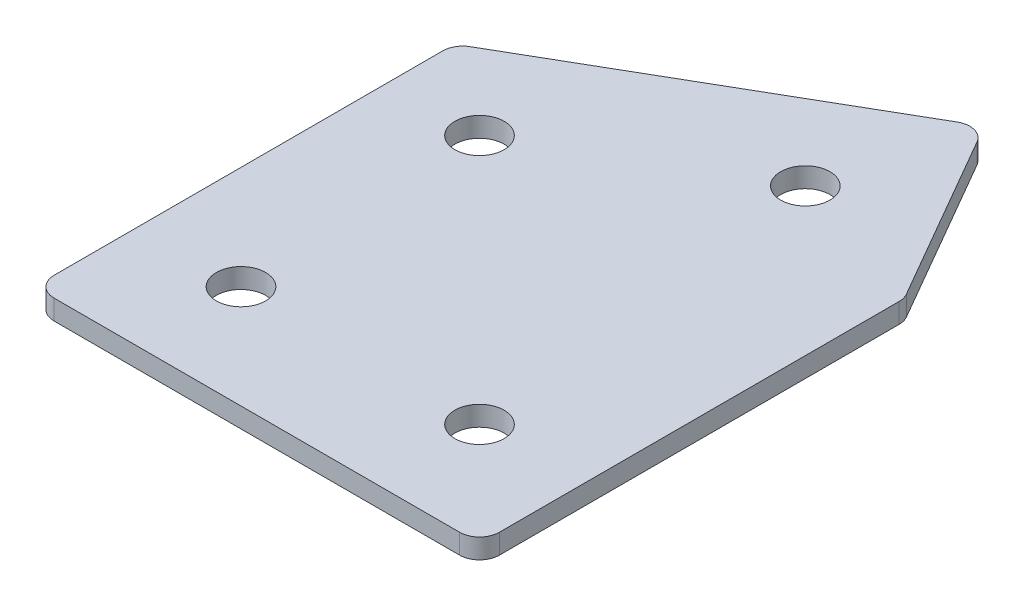
ISO-10303-21;
HEADER;
FILE_DESCRIPTION(('STEP AP214'),'2;1');
FILE_NAME('part.step','',(''),(''),'','','');
FILE_SCHEMA(('AUTOMOTIVE_DESIGN { 1 0 10303 214 1 1 1 1 }'));
ENDSEC;
DATA;
#1=APPLICATION_CONTEXT('core data for automotive mechanical design processes');
#2=APPLICATION_PROTOCOL_DEFINITION('international standard','automotive_design',2000,#1);
#3=PRODUCT_CONTEXT('',#1,'mechanical');
#4=PRODUCT('Part','Part','',(#3));
#5=PRODUCT_RELATED_PRODUCT_CATEGORY('part','',(#4));
#6=PRODUCT_DEFINITION_FORMATION('','',#4);
#7=PRODUCT_DEFINITION_CONTEXT('part definition',#1,'design');
#8=PRODUCT_DEFINITION('design','',#6,#7);
#9=PRODUCT_DEFINITION_SHAPE('','',#8);
#10=(LENGTH_UNIT() NAMED_UNIT(*) SI_UNIT(.MILLI.,.METRE.));
#11=(NAMED_UNIT(*) PLANE_ANGLE_UNIT() SI_UNIT($,.RADIAN.));
#12=(NAMED_UNIT(*) SI_UNIT($,.STERADIAN.) SOLID_ANGLE_UNIT());
#13=UNCERTAINTY_MEASURE_WITH_UNIT(LENGTH_MEASURE(1.E-05),#10,'distance_accuracy_value','');
#14=(GEOMETRIC_REPRESENTATION_CONTEXT(3) GLOBAL_UNCERTAINTY_ASSIGNED_CONTEXT((#13)) GLOBAL_UNIT_ASSIGNED_CONTEXT((#10,
#11,#12)) REPRESENTATION_CONTEXT('',''));
#15=CARTESIAN_POINT('',(0.,0.,0.));
#16=DIRECTION('',(0.,0.,1.));
#17=DIRECTION('',(1.,0.,0.));
#18=AXIS2_PLACEMENT_3D('',#15,#16,#17);
#19=CARTESIAN_POINT('',(0.,0.,0.));
#20=DIRECTION('',(0.,1.,0.));
#21=DIRECTION('',(0.,0.,1.));
#22=AXIS2_PLACEMENT_3D('',#19,#20,#21);
#23=PLANE('',#22);
#24=CARTESIAN_POINT('',(85.9807621135364,0.,0.));
#25=DIRECTION('',(0.,1.,0.));
#26=DIRECTION('',(0.,0.,1.));
#27=AXIS2_PLACEMENT_3D('',#24,#25,#26);
#28=CIRCLE('',#27,3.09999999999999);
#29=CARTESIAN_POINT('',(85.9807621135364,0.,3.09999999999999));
#30=VERTEX_POINT('',#29);
#31=EDGE_CURVE('E201',#30,#30,#28,.T.);
#32=ORIENTED_EDGE('',*,*,#31,.T.);
#33=EDGE_LOOP('',(#32));
#34=FACE_BOUND('',#33,.T.);
#35=CARTESIAN_POINT('',(80.4903810567697,0.,-46.4711431702998));
#36=DIRECTION('',(0.,1.,0.));
#37=DIRECTION('',(0.,0.,1.));
#38=AXIS2_PLACEMENT_3D('',#35,#36,#37);
#39=CIRCLE('',#38,3.09999999999999);
#40=CARTESIAN_POINT('',(80.4903810567697,0.,-43.3711431702999));
#41=VERTEX_POINT('',#40);
#42=EDGE_CURVE('E195',#41,#41,#39,.T.);
#43=ORIENTED_EDGE('',*,*,#42,.T.);
#44=EDGE_LOOP('',(#43));
#45=FACE_BOUND('',#44,.T.);
#46=CARTESIAN_POINT('',(54.5096189432366,0.,-31.4711431702999));
#47=DIRECTION('',(0.,1.,0.));
#48=DIRECTION('',(0.,0.,1.));
#49=AXIS2_PLACEMENT_3D('',#46,#47,#48);
#50=CIRCLE('',#49,3.09999999999999);
#51=CARTESIAN_POINT('',(54.5096189432366,0.,-28.3711431702999));
#52=VERTEX_POINT('',#51);
#53=EDGE_CURVE('E189',#52,#52,#50,.T.);
#54=ORIENTED_EDGE('',*,*,#53,.T.);
#55=EDGE_LOOP('',(#54));
#56=FACE_BOUND('',#55,.T.);
#57=CARTESIAN_POINT('',(55.9807621135364,0.,0.));
#58=DIRECTION('',(0.,1.,0.));
#59=DIRECTION('',(0.,0.,1.));
#60=AXIS2_PLACEMENT_3D('',#57,#58,#59);
#61=CIRCLE('',#60,3.1);
#62=CARTESIAN_POINT('',(55.9807621135364,0.,3.10000000000001));
#63=VERTEX_POINT('',#62);
#64=EDGE_CURVE('E115',#63,#63,#61,.T.);
#65=ORIENTED_EDGE('',*,*,#64,.T.);
#66=EDGE_LOOP('',(#65));
#67=FACE_BOUND('',#66,.T.);
#68=DIRECTION('',(0.,0.,1.));
#69=VECTOR('',#68,1.);
#70=CARTESIAN_POINT('',(42.9807621135364,0.,-39.8260615751544));
#71=LINE('',#70,#69);
#72=CARTESIAN_POINT('',(42.9807621135364,0.,-38.3826859021803));
#73=VERTEX_POINT('',#72);
#74=CARTESIAN_POINT('',(42.9807621135364,0.,10.5000000000001));
#75=VERTEX_POINT('',#74);
#76=EDGE_CURVE('E182',#73,#75,#71,.T.);
#77=ORIENTED_EDGE('',*,*,#76,.F.);
#78=CARTESIAN_POINT('',(45.4807621135364,0.,-38.3826859021803));
#79=DIRECTION('',(0.,1.,0.));
#80=DIRECTION('',(0.,0.,1.));
#81=AXIS2_PLACEMENT_3D('',#78,#79,#80);
#82=CIRCLE('',#81,2.5);
#83=CARTESIAN_POINT('',(44.2307621135364,0.,-40.5477494116414));
#84=VERTEX_POINT('',#83);
#85=EDGE_CURVE('E146',#73,#84,#82,.F.);
#86=ORIENTED_EDGE('',*,*,#85,.T.);
#87=DIRECTION('',(-0.866025403784438,0.,0.5));
#88=VECTOR('',#87,1.);
#89=CARTESIAN_POINT('',(85.2487113059672,0.,-64.2294734194978));
#90=LINE('',#89,#88);
#91=CARTESIAN_POINT('',(83.0836477965062,0.,-62.9794734194978));
#92=VERTEX_POINT('',#91);
#93=EDGE_CURVE('E174',#92,#84,#90,.T.);
#94=ORIENTED_EDGE('',*,*,#93,.F.);
#95=CARTESIAN_POINT('',(84.3336477965062,0.,-60.8144099100367));
#96=DIRECTION('',(0.,1.,0.));
#97=DIRECTION('',(0.,0.,1.));
#98=AXIS2_PLACEMENT_3D('',#95,#96,#97);
#99=CIRCLE('',#98,2.5);
#100=CARTESIAN_POINT('',(86.4987113059672,0.,-62.0644099100367));
#101=VERTEX_POINT('',#100);
#102=EDGE_CURVE('E118',#92,#101,#99,.F.);
#103=ORIENTED_EDGE('',*,*,#102,.T.);
#104=DIRECTION('',(-0.500000000000002,0.,-0.866025403784437));
#105=VECTOR('',#104,1.);
#106=CARTESIAN_POINT('',(98.9807621135364,0.,-40.4448637286709));
#107=LINE('',#106,#105);
#108=CARTESIAN_POINT('',(98.6458256229975,0.,-41.0249907475931));
#109=VERTEX_POINT('',#108);
#110=EDGE_CURVE('E119',#109,#101,#107,.T.);
#111=ORIENTED_EDGE('',*,*,#110,.F.);
#112=CARTESIAN_POINT('',(96.4807621135364,0.,-39.7749907475931));
#113=DIRECTION('',(0.,1.,0.));
#114=DIRECTION('',(0.,0.,1.));
#115=AXIS2_PLACEMENT_3D('',#112,#113,#114);
#116=CIRCLE('',#115,2.5);
#117=CARTESIAN_POINT('',(98.9807621135364,0.,-39.7749907475931));
#118=VERTEX_POINT('',#117);
#119=EDGE_CURVE('E141',#109,#118,#116,.F.);
#120=ORIENTED_EDGE('',*,*,#119,.T.);
#121=DIRECTION('',(0.,0.,-1.));
#122=VECTOR('',#121,1.);
#123=CARTESIAN_POINT('',(98.9807621135364,0.,13.0000000000001));
#124=LINE('',#123,#122);
#125=CARTESIAN_POINT('',(98.9807621135364,0.,10.5000000000001));
#126=VERTEX_POINT('',#125);
#127=EDGE_CURVE('E123',#126,#118,#124,.T.);
#128=ORIENTED_EDGE('',*,*,#127,.F.);
#129=CARTESIAN_POINT('',(96.4807621135364,0.,10.5000000000001));
#130=DIRECTION('',(0.,1.,0.));
#131=DIRECTION('',(0.,0.,1.));
#132=AXIS2_PLACEMENT_3D('',#129,#130,#131);
#133=CIRCLE('',#132,2.5);
#134=CARTESIAN_POINT('',(96.4807621135363,0.,13.0000000000001));
#135=VERTEX_POINT('',#134);
#136=EDGE_CURVE('E31',#126,#135,#133,.F.);
#137=ORIENTED_EDGE('',*,*,#136,.T.);
#138=DIRECTION('',(1.,0.,0.));
#139=VECTOR('',#138,1.);
#140=CARTESIAN_POINT('',(42.9807621135364,0.,13.0000000000001));
#141=LINE('',#140,#139);
#142=CARTESIAN_POINT('',(45.4807621135364,0.,13.0000000000001));
#143=VERTEX_POINT('',#142);
#144=EDGE_CURVE('E180',#143,#135,#141,.T.);
#145=ORIENTED_EDGE('',*,*,#144,.F.);
#146=CARTESIAN_POINT('',(45.4807621135364,0.,10.5000000000001));
#147=DIRECTION('',(0.,1.,0.));
#148=DIRECTION('',(0.,0.,1.));
#149=AXIS2_PLACEMENT_3D('',#146,#147,#148);
#150=CIRCLE('',#149,2.5);
#151=EDGE_CURVE('E144',#143,#75,#150,.F.);
#152=ORIENTED_EDGE('',*,*,#151,.T.);
#153=EDGE_LOOP('',(#77,#86,#94,#103,#111,#120,#128,#137,#145,#152));
#154=FACE_BOUND('',#153,.T.);
#155=ADVANCED_FACE('F16',(#34,#45,#56,#67,#154),#23,.F.);
#156=CARTESIAN_POINT('',(85.2487113059672,0.,-64.2294734194978));
#157=DIRECTION('',(-0.5,0.,-0.866025403784438));
#158=DIRECTION('',(-0.866025403784438,0.,0.5));
#159=AXIS2_PLACEMENT_3D('',#156,#157,#158);
#160=PLANE('',#159);
#161=ORIENTED_EDGE('',*,*,#93,.T.);
#162=DIRECTION('',(0.,1.,0.));
#163=VECTOR('',#162,1.);
#164=CARTESIAN_POINT('',(44.2307621135364,0.,-40.5477494116414));
#165=LINE('',#164,#163);
#166=CARTESIAN_POINT('',(44.2307621135364,2.5,-40.5477494116414));
#167=VERTEX_POINT('',#166);
#168=EDGE_CURVE('E105',#84,#167,#165,.T.);
#169=ORIENTED_EDGE('',*,*,#168,.T.);
#170=DIRECTION('',(-0.866025403784438,0.,0.5));
#171=VECTOR('',#170,1.);
#172=CARTESIAN_POINT('',(85.2487113059672,2.5,-64.2294734194978));
#173=LINE('',#172,#171);
#174=CARTESIAN_POINT('',(83.0836477965062,2.5,-62.9794734194978));
#175=VERTEX_POINT('',#174);
#176=EDGE_CURVE('E97',#175,#167,#173,.T.);
#177=ORIENTED_EDGE('',*,*,#176,.F.);
#178=DIRECTION('',(0.,1.,0.));
#179=VECTOR('',#178,1.);
#180=CARTESIAN_POINT('',(83.0836477965062,0.,-62.9794734194978));
#181=LINE('',#180,#179);
#182=EDGE_CURVE('E111',#175,#92,#181,.F.);
#183=ORIENTED_EDGE('',*,*,#182,.T.);
#184=EDGE_LOOP('',(#161,#169,#177,#183));
#185=FACE_BOUND('',#184,.T.);
#186=ADVANCED_FACE('F110',(#185),#160,.T.);
#187=CARTESIAN_POINT('',(98.9807621135364,0.,-40.4448637286709));
#188=DIRECTION('',(0.866025403784438,0.,-0.500000000000002));
#189=DIRECTION('',(-0.500000000000002,0.,-0.866025403784438));
#190=AXIS2_PLACEMENT_3D('',#187,#188,#189);
#191=PLANE('',#190);
#192=DIRECTION('',(-0.500000000000002,0.,-0.866025403784437));
#193=VECTOR('',#192,1.);
#194=CARTESIAN_POINT('',(98.9807621135364,2.5,-40.4448637286709));
#195=LINE('',#194,#193);
#196=CARTESIAN_POINT('',(98.6458256229975,2.5,-41.0249907475931));
#197=VERTEX_POINT('',#196);
#198=CARTESIAN_POINT('',(86.4987113059672,2.5,-62.0644099100367));
#199=VERTEX_POINT('',#198);
#200=EDGE_CURVE('E99',#197,#199,#195,.T.);
#201=ORIENTED_EDGE('',*,*,#200,.F.);
#202=DIRECTION('',(0.,1.,0.));
#203=VECTOR('',#202,1.);
#204=CARTESIAN_POINT('',(98.6458256229975,0.,-41.0249907475931));
#205=LINE('',#204,#203);
#206=EDGE_CURVE('E10',#197,#109,#205,.F.);
#207=ORIENTED_EDGE('',*,*,#206,.T.);
#208=ORIENTED_EDGE('',*,*,#110,.T.);
#209=DIRECTION('',(0.,1.,0.));
#210=VECTOR('',#209,1.);
#211=CARTESIAN_POINT('',(86.4987113059672,0.,-62.0644099100367));
#212=LINE('',#211,#210);
#213=EDGE_CURVE('E24',#101,#199,#212,.T.);
#214=ORIENTED_EDGE('',*,*,#213,.T.);
#215=EDGE_LOOP('',(#201,#207,#208,#214));
#216=FACE_BOUND('',#215,.T.);
#217=ADVANCED_FACE('F157',(#216),#191,.T.);
#218=CARTESIAN_POINT('',(98.9807621135364,0.,13.0000000000001));
#219=DIRECTION('',(1.,0.,0.));
#220=DIRECTION('',(0.,0.,-1.));
#221=AXIS2_PLACEMENT_3D('',#218,#219,#220);
#222=PLANE('',#221);
#223=DIRECTION('',(0.,0.,-1.));
#224=VECTOR('',#223,1.);
#225=CARTESIAN_POINT('',(98.9807621135364,2.5,13.0000000000001));
#226=LINE('',#225,#224);
#227=CARTESIAN_POINT('',(98.9807621135364,2.5,10.5000000000001));
#228=VERTEX_POINT('',#227);
#229=CARTESIAN_POINT('',(98.9807621135364,2.5,-39.7749907475931));
#230=VERTEX_POINT('',#229);
#231=EDGE_CURVE('E170',#228,#230,#226,.T.);
#232=ORIENTED_EDGE('',*,*,#231,.F.);
#233=DIRECTION('',(0.,1.,0.));
#234=VECTOR('',#233,1.);
#235=CARTESIAN_POINT('',(98.9807621135364,0.,10.5000000000001));
#236=LINE('',#235,#234);
#237=EDGE_CURVE('E155',#228,#126,#236,.F.);
#238=ORIENTED_EDGE('',*,*,#237,.T.);
#239=ORIENTED_EDGE('',*,*,#127,.T.);
#240=DIRECTION('',(0.,1.,0.));
#241=VECTOR('',#240,1.);
#242=CARTESIAN_POINT('',(98.9807621135364,0.,-39.7749907475931));
#243=LINE('',#242,#241);
#244=EDGE_CURVE('E152',#118,#230,#243,.T.);
#245=ORIENTED_EDGE('',*,*,#244,.T.);
#246=EDGE_LOOP('',(#232,#238,#239,#245));
#247=FACE_BOUND('',#246,.T.);
#248=ADVANCED_FACE('F169',(#247),#222,.T.);
#249=CARTESIAN_POINT('',(42.9807621135364,0.,13.0000000000001));
#250=DIRECTION('',(0.,0.,1.));
#251=DIRECTION('',(1.,0.,0.));
#252=AXIS2_PLACEMENT_3D('',#249,#250,#251);
#253=PLANE('',#252);
#254=DIRECTION('',(1.,0.,0.));
#255=VECTOR('',#254,1.);
#256=CARTESIAN_POINT('',(42.9807621135364,2.5,13.0000000000001));
#257=LINE('',#256,#255);
#258=CARTESIAN_POINT('',(45.4807621135364,2.5,13.0000000000001));
#259=VERTEX_POINT('',#258);
#260=CARTESIAN_POINT('',(96.4807621135363,2.5,13.0000000000001));
#261=VERTEX_POINT('',#260);
#262=EDGE_CURVE('E173',#259,#261,#257,.T.);
#263=ORIENTED_EDGE('',*,*,#262,.F.);
#264=DIRECTION('',(0.,1.,0.));
#265=VECTOR('',#264,1.);
#266=CARTESIAN_POINT('',(45.4807621135364,0.,13.0000000000001));
#267=LINE('',#266,#265);
#268=EDGE_CURVE('E38',#259,#143,#267,.F.);
#269=ORIENTED_EDGE('',*,*,#268,.T.);
#270=ORIENTED_EDGE('',*,*,#144,.T.);
#271=DIRECTION('',(0.,1.,0.));
#272=VECTOR('',#271,1.);
#273=CARTESIAN_POINT('',(96.4807621135364,0.,13.0000000000001));
#274=LINE('',#273,#272);
#275=EDGE_CURVE('E148',#135,#261,#274,.T.);
#276=ORIENTED_EDGE('',*,*,#275,.T.);
#277=EDGE_LOOP('',(#263,#269,#270,#276));
#278=FACE_BOUND('',#277,.T.);
#279=ADVANCED_FACE('F337',(#278),#253,.T.);
#280=CARTESIAN_POINT('',(42.9807621135364,0.,-39.8260615751544));
#281=DIRECTION('',(-1.,0.,0.));
#282=DIRECTION('',(0.,0.,1.));
#283=AXIS2_PLACEMENT_3D('',#280,#281,#282);
#284=PLANE('',#283);
#285=DIRECTION('',(0.,0.,1.));
#286=VECTOR('',#285,1.);
#287=CARTESIAN_POINT('',(42.9807621135364,2.5,-39.8260615751544));
#288=LINE('',#287,#286);
#289=CARTESIAN_POINT('',(42.9807621135364,2.5,-38.3826859021803));
#290=VERTEX_POINT('',#289);
#291=CARTESIAN_POINT('',(42.9807621135364,2.5,10.5000000000001));
#292=VERTEX_POINT('',#291);
#293=EDGE_CURVE('E114',#290,#292,#288,.T.);
#294=ORIENTED_EDGE('',*,*,#293,.F.);
#295=DIRECTION('',(0.,1.,0.));
#296=VECTOR('',#295,1.);
#297=CARTESIAN_POINT('',(42.9807621135364,0.,-38.3826859021803));
#298=LINE('',#297,#296);
#299=EDGE_CURVE('E138',#290,#73,#298,.F.);
#300=ORIENTED_EDGE('',*,*,#299,.T.);
#301=ORIENTED_EDGE('',*,*,#76,.T.);
#302=DIRECTION('',(0.,1.,0.));
#303=VECTOR('',#302,1.);
#304=CARTESIAN_POINT('',(42.9807621135364,0.,10.5000000000001));
#305=LINE('',#304,#303);
#306=EDGE_CURVE('E135',#75,#292,#305,.T.);
#307=ORIENTED_EDGE('',*,*,#306,.T.);
#308=EDGE_LOOP('',(#294,#300,#301,#307));
#309=FACE_BOUND('',#308,.T.);
#310=ADVANCED_FACE('F223',(#309),#284,.T.);
#311=CARTESIAN_POINT('',(0.,2.5,0.));
#312=DIRECTION('',(0.,1.,0.));
#313=DIRECTION('',(0.,0.,1.));
#314=AXIS2_PLACEMENT_3D('',#311,#312,#313);
#315=PLANE('',#314);
#316=CARTESIAN_POINT('',(85.9807621135364,2.5,0.));
#317=DIRECTION('',(0.,1.,0.));
#318=DIRECTION('',(0.,0.,1.));
#319=AXIS2_PLACEMENT_3D('',#316,#317,#318);
#320=CIRCLE('',#319,3.09999999999999);
#321=CARTESIAN_POINT('',(85.9807621135364,2.5,3.09999999999999));
#322=VERTEX_POINT('',#321);
#323=EDGE_CURVE('E204',#322,#322,#320,.T.);
#324=ORIENTED_EDGE('',*,*,#323,.F.);
#325=EDGE_LOOP('',(#324));
#326=FACE_BOUND('',#325,.T.);
#327=CARTESIAN_POINT('',(80.4903810567697,2.5,-46.4711431702998));
#328=DIRECTION('',(0.,1.,0.));
#329=DIRECTION('',(0.,0.,1.));
#330=AXIS2_PLACEMENT_3D('',#327,#328,#329);
#331=CIRCLE('',#330,3.09999999999999);
#332=CARTESIAN_POINT('',(80.4903810567697,2.5,-43.3711431702999));
#333=VERTEX_POINT('',#332);
#334=EDGE_CURVE('E198',#333,#333,#331,.T.);
#335=ORIENTED_EDGE('',*,*,#334,.F.);
#336=EDGE_LOOP('',(#335));
#337=FACE_BOUND('',#336,.T.);
#338=CARTESIAN_POINT('',(54.5096189432366,2.5,-31.4711431702999));
#339=DIRECTION('',(0.,1.,0.));
#340=DIRECTION('',(0.,0.,1.));
#341=AXIS2_PLACEMENT_3D('',#338,#339,#340);
#342=CIRCLE('',#341,3.09999999999999);
#343=CARTESIAN_POINT('',(54.5096189432366,2.5,-28.3711431702999));
#344=VERTEX_POINT('',#343);
#345=EDGE_CURVE('E192',#344,#344,#342,.T.);
#346=ORIENTED_EDGE('',*,*,#345,.F.);
#347=EDGE_LOOP('',(#346));
#348=FACE_BOUND('',#347,.T.);
#349=CARTESIAN_POINT('',(55.9807621135364,2.5,0.));
#350=DIRECTION('',(0.,1.,0.));
#351=DIRECTION('',(0.,0.,1.));
#352=AXIS2_PLACEMENT_3D('',#349,#350,#351);
#353=CIRCLE('',#352,3.1);
#354=CARTESIAN_POINT('',(55.9807621135364,2.5,3.10000000000001));
#355=VERTEX_POINT('',#354);
#356=EDGE_CURVE('E186',#355,#355,#353,.T.);
#357=ORIENTED_EDGE('',*,*,#356,.F.);
#358=EDGE_LOOP('',(#357));
#359=FACE_BOUND('',#358,.T.);
#360=ORIENTED_EDGE('',*,*,#176,.T.);
#361=CARTESIAN_POINT('',(45.4807621135364,2.5,-38.3826859021803));
#362=DIRECTION('',(0.,1.,0.));
#363=DIRECTION('',(0.,0.,1.));
#364=AXIS2_PLACEMENT_3D('',#361,#362,#363);
#365=CIRCLE('',#364,2.5);
#366=EDGE_CURVE('E133',#167,#290,#365,.T.);
#367=ORIENTED_EDGE('',*,*,#366,.T.);
#368=ORIENTED_EDGE('',*,*,#293,.T.);
#369=CARTESIAN_POINT('',(45.4807621135364,2.5,10.5000000000001));
#370=DIRECTION('',(0.,1.,0.));
#371=DIRECTION('',(0.,0.,1.));
#372=AXIS2_PLACEMENT_3D('',#369,#370,#371);
#373=CIRCLE('',#372,2.5);
#374=EDGE_CURVE('E131',#292,#259,#373,.T.);
#375=ORIENTED_EDGE('',*,*,#374,.T.);
#376=ORIENTED_EDGE('',*,*,#262,.T.);
#377=CARTESIAN_POINT('',(96.4807621135364,2.5,10.5000000000001));
#378=DIRECTION('',(0.,1.,0.));
#379=DIRECTION('',(0.,0.,1.));
#380=AXIS2_PLACEMENT_3D('',#377,#378,#379);
#381=CIRCLE('',#380,2.5);
#382=EDGE_CURVE('E129',#261,#228,#381,.T.);
#383=ORIENTED_EDGE('',*,*,#382,.T.);
#384=ORIENTED_EDGE('',*,*,#231,.T.);
#385=CARTESIAN_POINT('',(96.4807621135364,2.5,-39.7749907475931));
#386=DIRECTION('',(0.,1.,0.));
#387=DIRECTION('',(0.,0.,1.));
#388=AXIS2_PLACEMENT_3D('',#385,#386,#387);
#389=CIRCLE('',#388,2.5);
#390=EDGE_CURVE('E104',#230,#197,#389,.T.);
#391=ORIENTED_EDGE('',*,*,#390,.T.);
#392=ORIENTED_EDGE('',*,*,#200,.T.);
#393=CARTESIAN_POINT('',(84.3336477965062,2.5,-60.8144099100367));
#394=DIRECTION('',(0.,1.,0.));
#395=DIRECTION('',(0.,0.,1.));
#396=AXIS2_PLACEMENT_3D('',#393,#394,#395);
#397=CIRCLE('',#396,2.5);
#398=EDGE_CURVE('E94',#199,#175,#397,.T.);
#399=ORIENTED_EDGE('',*,*,#398,.T.);
#400=EDGE_LOOP('',(#360,#367,#368,#375,#376,#383,#384,#391,#392,#399));
#401=FACE_BOUND('',#400,.T.);
#402=ADVANCED_FACE('F96',(#326,#337,#348,#359,#401),#315,.T.);
#403=CARTESIAN_POINT('',(55.9807621135364,0.,0.));
#404=DIRECTION('',(0.,1.,0.));
#405=DIRECTION('',(0.,0.,1.));
#406=AXIS2_PLACEMENT_3D('',#403,#404,#405);
#407=CYLINDRICAL_SURFACE('',#406,3.1);
#408=ORIENTED_EDGE('',*,*,#64,.F.);
#409=EDGE_LOOP('',(#408));
#410=FACE_BOUND('',#409,.T.);
#411=ORIENTED_EDGE('',*,*,#356,.T.);
#412=EDGE_LOOP('',(#411));
#413=FACE_BOUND('',#412,.T.);
#414=ADVANCED_FACE('F222',(#410,#413),#407,.F.);
#415=CARTESIAN_POINT('',(54.5096189432366,0.,-31.4711431702999));
#416=DIRECTION('',(0.,1.,0.));
#417=DIRECTION('',(0.,0.,1.));
#418=AXIS2_PLACEMENT_3D('',#415,#416,#417);
#419=CYLINDRICAL_SURFACE('',#418,3.09999999999999);
#420=ORIENTED_EDGE('',*,*,#53,.F.);
#421=EDGE_LOOP('',(#420));
#422=FACE_BOUND('',#421,.T.);
#423=ORIENTED_EDGE('',*,*,#345,.T.);
#424=EDGE_LOOP('',(#423));
#425=FACE_BOUND('',#424,.T.);
#426=ADVANCED_FACE('F232',(#422,#425),#419,.F.);
#427=CARTESIAN_POINT('',(80.4903810567697,0.,-46.4711431702998));
#428=DIRECTION('',(0.,1.,0.));
#429=DIRECTION('',(0.,0.,1.));
#430=AXIS2_PLACEMENT_3D('',#427,#428,#429);
#431=CYLINDRICAL_SURFACE('',#430,3.09999999999999);
#432=ORIENTED_EDGE('',*,*,#42,.F.);
#433=EDGE_LOOP('',(#432));
#434=FACE_BOUND('',#433,.T.);
#435=ORIENTED_EDGE('',*,*,#334,.T.);
#436=EDGE_LOOP('',(#435));
#437=FACE_BOUND('',#436,.T.);
#438=ADVANCED_FACE('F216',(#434,#437),#431,.F.);
#439=CARTESIAN_POINT('',(85.9807621135364,0.,0.));
#440=DIRECTION('',(0.,1.,0.));
#441=DIRECTION('',(0.,0.,1.));
#442=AXIS2_PLACEMENT_3D('',#439,#440,#441);
#443=CYLINDRICAL_SURFACE('',#442,3.09999999999999);
#444=ORIENTED_EDGE('',*,*,#31,.F.);
#445=EDGE_LOOP('',(#444));
#446=FACE_BOUND('',#445,.T.);
#447=ORIENTED_EDGE('',*,*,#323,.T.);
#448=EDGE_LOOP('',(#447));
#449=FACE_BOUND('',#448,.T.);
#450=ADVANCED_FACE('F212',(#446,#449),#443,.F.);
#451=CARTESIAN_POINT('',(45.4807621135364,0.,-38.3826859021803));
#452=DIRECTION('',(0.,1.,0.));
#453=DIRECTION('',(0.,0.,1.));
#454=AXIS2_PLACEMENT_3D('',#451,#452,#453);
#455=CYLINDRICAL_SURFACE('',#454,2.5);
#456=ORIENTED_EDGE('',*,*,#85,.F.);
#457=ORIENTED_EDGE('',*,*,#299,.F.);
#458=ORIENTED_EDGE('',*,*,#366,.F.);
#459=ORIENTED_EDGE('',*,*,#168,.F.);
#460=EDGE_LOOP('',(#456,#457,#458,#459));
#461=FACE_BOUND('',#460,.T.);
#462=ADVANCED_FACE('F215',(#461),#455,.T.);
#463=CARTESIAN_POINT('',(45.4807621135364,0.,10.5000000000001));
#464=DIRECTION('',(0.,1.,0.));
#465=DIRECTION('',(0.,0.,1.));
#466=AXIS2_PLACEMENT_3D('',#463,#464,#465);
#467=CYLINDRICAL_SURFACE('',#466,2.5);
#468=ORIENTED_EDGE('',*,*,#151,.F.);
#469=ORIENTED_EDGE('',*,*,#268,.F.);
#470=ORIENTED_EDGE('',*,*,#374,.F.);
#471=ORIENTED_EDGE('',*,*,#306,.F.);
#472=EDGE_LOOP('',(#468,#469,#470,#471));
#473=FACE_BOUND('',#472,.T.);
#474=ADVANCED_FACE('F252',(#473),#467,.T.);
#475=CARTESIAN_POINT('',(96.4807621135364,0.,10.5000000000001));
#476=DIRECTION('',(0.,1.,0.));
#477=DIRECTION('',(0.,0.,1.));
#478=AXIS2_PLACEMENT_3D('',#475,#476,#477);
#479=CYLINDRICAL_SURFACE('',#478,2.5);
#480=ORIENTED_EDGE('',*,*,#136,.F.);
#481=ORIENTED_EDGE('',*,*,#237,.F.);
#482=ORIENTED_EDGE('',*,*,#382,.F.);
#483=ORIENTED_EDGE('',*,*,#275,.F.);
#484=EDGE_LOOP('',(#480,#481,#482,#483));
#485=FACE_BOUND('',#484,.T.);
#486=ADVANCED_FACE('F256',(#485),#479,.T.);
#487=CARTESIAN_POINT('',(96.4807621135364,0.,-39.7749907475931));
#488=DIRECTION('',(0.,1.,0.));
#489=DIRECTION('',(0.,0.,1.));
#490=AXIS2_PLACEMENT_3D('',#487,#488,#489);
#491=CYLINDRICAL_SURFACE('',#490,2.5);
#492=ORIENTED_EDGE('',*,*,#119,.F.);
#493=ORIENTED_EDGE('',*,*,#206,.F.);
#494=ORIENTED_EDGE('',*,*,#390,.F.);
#495=ORIENTED_EDGE('',*,*,#244,.F.);
#496=EDGE_LOOP('',(#492,#493,#494,#495));
#497=FACE_BOUND('',#496,.T.);
#498=ADVANCED_FACE('F165',(#497),#491,.T.);
#499=CARTESIAN_POINT('',(84.3336477965062,0.,-60.8144099100367));
#500=DIRECTION('',(0.,1.,0.));
#501=DIRECTION('',(0.,0.,1.));
#502=AXIS2_PLACEMENT_3D('',#499,#500,#501);
#503=CYLINDRICAL_SURFACE('',#502,2.5);
#504=ORIENTED_EDGE('',*,*,#102,.F.);
#505=ORIENTED_EDGE('',*,*,#182,.F.);
#506=ORIENTED_EDGE('',*,*,#398,.F.);
#507=ORIENTED_EDGE('',*,*,#213,.F.);
#508=EDGE_LOOP('',(#504,#505,#506,#507));
#509=FACE_BOUND('',#508,.T.);
#510=ADVANCED_FACE('F18',(#509),#503,.T.);
#511=CLOSED_SHELL('',(#155,#186,#217,#248,#279,#310,#402,#414,#426,#438,#450,#462,#474,#486,
#498,#510));
#512=MANIFOLD_SOLID_BREP('B1',#511);
#513=ADVANCED_BREP_SHAPE_REPRESENTATION('',(#18,#512),#14);
#514=SHAPE_DEFINITION_REPRESENTATION(#9,#513);
ENDSEC;
END-ISO-10303-21;
